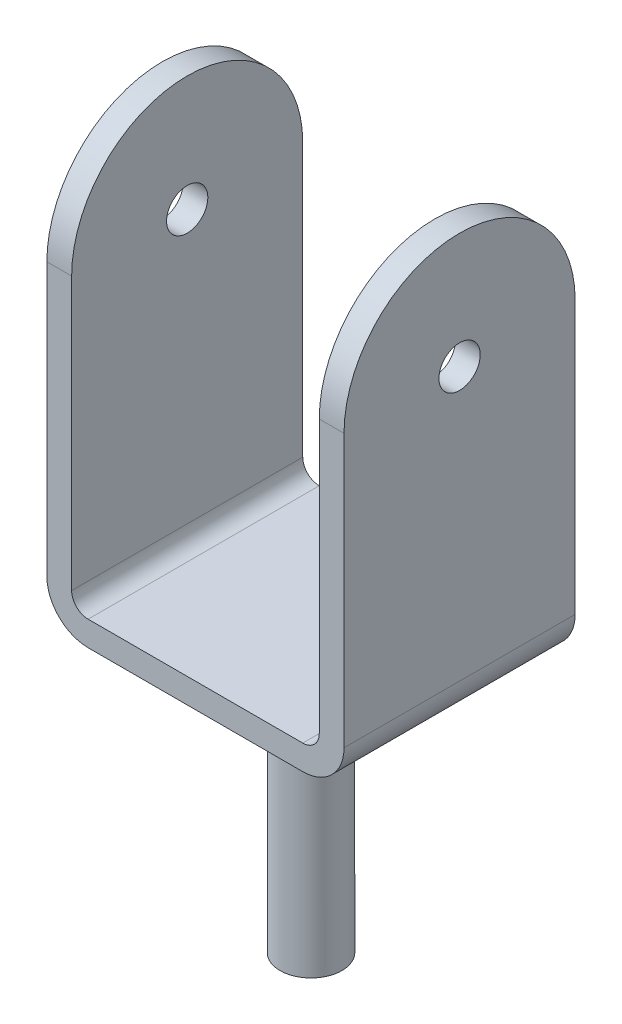
ISO-10303-21;
HEADER;
FILE_DESCRIPTION(('STEP AP214'),'2;1');
FILE_NAME('part.step','',(''),(''),'','','');
FILE_SCHEMA(('AUTOMOTIVE_DESIGN { 1 0 10303 214 1 1 1 1 }'));
ENDSEC;
DATA;
#1=APPLICATION_CONTEXT('core data for automotive mechanical design processes');
#2=APPLICATION_PROTOCOL_DEFINITION('international standard','automotive_design',2000,#1);
#3=PRODUCT_CONTEXT('',#1,'mechanical');
#4=PRODUCT('Part','Part','',(#3));
#5=PRODUCT_RELATED_PRODUCT_CATEGORY('part','',(#4));
#6=PRODUCT_DEFINITION_FORMATION('','',#4);
#7=PRODUCT_DEFINITION_CONTEXT('part definition',#1,'design');
#8=PRODUCT_DEFINITION('design','',#6,#7);
#9=PRODUCT_DEFINITION_SHAPE('','',#8);
#10=(LENGTH_UNIT() NAMED_UNIT(*) SI_UNIT(.MILLI.,.METRE.));
#11=(NAMED_UNIT(*) PLANE_ANGLE_UNIT() SI_UNIT($,.RADIAN.));
#12=(NAMED_UNIT(*) SI_UNIT($,.STERADIAN.) SOLID_ANGLE_UNIT());
#13=UNCERTAINTY_MEASURE_WITH_UNIT(LENGTH_MEASURE(1.E-05),#10,'distance_accuracy_value','');
#14=(GEOMETRIC_REPRESENTATION_CONTEXT(3) GLOBAL_UNCERTAINTY_ASSIGNED_CONTEXT((#13)) GLOBAL_UNIT_ASSIGNED_CONTEXT((#10,
#11,#12)) REPRESENTATION_CONTEXT('',''));
#15=CARTESIAN_POINT('',(0.,0.,0.));
#16=DIRECTION('',(0.,0.,1.));
#17=DIRECTION('',(1.,0.,0.));
#18=AXIS2_PLACEMENT_3D('',#15,#16,#17);
#19=CARTESIAN_POINT('',(130.,50.,-280.));
#20=DIRECTION('',(0.,0.,1.));
#21=DIRECTION('',(1.,0.,0.));
#22=AXIS2_PLACEMENT_3D('',#19,#20,#21);
#23=CYLINDRICAL_SURFACE('',#22,50.);
#24=CARTESIAN_POINT('',(130.,50.,0.));
#25=DIRECTION('',(0.,0.,1.));
#26=DIRECTION('',(1.,0.,0.));
#27=AXIS2_PLACEMENT_3D('',#24,#25,#26);
#28=CIRCLE('',#27,50.);
#29=CARTESIAN_POINT('',(130.,0.,0.));
#30=VERTEX_POINT('',#29);
#31=CARTESIAN_POINT('',(180.,50.0000000000004,0.));
#32=VERTEX_POINT('',#31);
#33=EDGE_CURVE('E147',#30,#32,#28,.T.);
#34=ORIENTED_EDGE('',*,*,#33,.F.);
#35=DIRECTION('',(0.,0.,1.));
#36=VECTOR('',#35,1.);
#37=CARTESIAN_POINT('',(130.,0.,-280.));
#38=LINE('',#37,#36);
#39=CARTESIAN_POINT('',(130.,0.,-280.));
#40=VERTEX_POINT('',#39);
#41=EDGE_CURVE('E45',#40,#30,#38,.T.);
#42=ORIENTED_EDGE('',*,*,#41,.F.);
#43=CARTESIAN_POINT('',(130.,50.,-280.));
#44=DIRECTION('',(0.,0.,1.));
#45=DIRECTION('',(1.,0.,0.));
#46=AXIS2_PLACEMENT_3D('',#43,#44,#45);
#47=CIRCLE('',#46,50.);
#48=CARTESIAN_POINT('',(180.,50.0000000000004,-280.));
#49=VERTEX_POINT('',#48);
#50=EDGE_CURVE('E181',#40,#49,#47,.T.);
#51=ORIENTED_EDGE('',*,*,#50,.T.);
#52=DIRECTION('',(0.,0.,1.));
#53=VECTOR('',#52,1.);
#54=CARTESIAN_POINT('',(180.,50.0000000000004,-280.));
#55=LINE('',#54,#53);
#56=EDGE_CURVE('E100',#49,#32,#55,.T.);
#57=ORIENTED_EDGE('',*,*,#56,.T.);
#58=EDGE_LOOP('',(#34,#42,#51,#57));
#59=FACE_BOUND('',#58,.T.);
#60=ADVANCED_FACE('F37',(#59),#23,.T.);
#61=CARTESIAN_POINT('',(-130.,0.,-280.));
#62=DIRECTION('',(0.,-1.,0.));
#63=DIRECTION('',(0.,0.,-1.));
#64=AXIS2_PLACEMENT_3D('',#61,#62,#63);
#65=PLANE('',#64);
#66=CARTESIAN_POINT('',(0.,0.,-140.));
#67=DIRECTION('',(0.,-1.,0.));
#68=DIRECTION('',(0.,0.,-1.));
#69=AXIS2_PLACEMENT_3D('',#66,#67,#68);
#70=CIRCLE('',#69,37.5);
#71=CARTESIAN_POINT('',(0.,0.,-177.5));
#72=VERTEX_POINT('',#71);
#73=EDGE_CURVE('E11',#72,#72,#70,.T.);
#74=ORIENTED_EDGE('',*,*,#73,.F.);
#75=EDGE_LOOP('',(#74));
#76=FACE_BOUND('',#75,.T.);
#77=DIRECTION('',(1.,0.,0.));
#78=VECTOR('',#77,1.);
#79=CARTESIAN_POINT('',(-130.,0.,0.));
#80=LINE('',#79,#78);
#81=CARTESIAN_POINT('',(-130.,0.,0.));
#82=VERTEX_POINT('',#81);
#83=EDGE_CURVE('E178',#82,#30,#80,.T.);
#84=ORIENTED_EDGE('',*,*,#83,.F.);
#85=DIRECTION('',(0.,0.,1.));
#86=VECTOR('',#85,1.);
#87=CARTESIAN_POINT('',(-130.,0.,-280.));
#88=LINE('',#87,#86);
#89=CARTESIAN_POINT('',(-130.,0.,-280.));
#90=VERTEX_POINT('',#89);
#91=EDGE_CURVE('E88',#90,#82,#88,.T.);
#92=ORIENTED_EDGE('',*,*,#91,.F.);
#93=DIRECTION('',(1.,0.,0.));
#94=VECTOR('',#93,1.);
#95=CARTESIAN_POINT('',(-130.,0.,-280.));
#96=LINE('',#95,#94);
#97=EDGE_CURVE('E134',#90,#40,#96,.T.);
#98=ORIENTED_EDGE('',*,*,#97,.T.);
#99=ORIENTED_EDGE('',*,*,#41,.T.);
#100=EDGE_LOOP('',(#84,#92,#98,#99));
#101=FACE_BOUND('',#100,.T.);
#102=ADVANCED_FACE('F196',(#76,#101),#65,.T.);
#103=CARTESIAN_POINT('',(-130.,50.,-280.));
#104=DIRECTION('',(0.,0.,1.));
#105=DIRECTION('',(1.,0.,0.));
#106=AXIS2_PLACEMENT_3D('',#103,#104,#105);
#107=CYLINDRICAL_SURFACE('',#106,50.);
#108=CARTESIAN_POINT('',(-130.,50.,0.));
#109=DIRECTION('',(0.,0.,1.));
#110=DIRECTION('',(-1.,0.,0.));
#111=AXIS2_PLACEMENT_3D('',#108,#109,#110);
#112=CIRCLE('',#111,50.);
#113=CARTESIAN_POINT('',(-180.,50.,0.));
#114=VERTEX_POINT('',#113);
#115=EDGE_CURVE('E121',#114,#82,#112,.T.);
#116=ORIENTED_EDGE('',*,*,#115,.F.);
#117=DIRECTION('',(0.,0.,1.));
#118=VECTOR('',#117,1.);
#119=CARTESIAN_POINT('',(-180.,50.,-280.));
#120=LINE('',#119,#118);
#121=CARTESIAN_POINT('',(-180.,50.,-280.));
#122=VERTEX_POINT('',#121);
#123=EDGE_CURVE('E116',#122,#114,#120,.T.);
#124=ORIENTED_EDGE('',*,*,#123,.F.);
#125=CARTESIAN_POINT('',(-130.,50.,-280.));
#126=DIRECTION('',(0.,0.,1.));
#127=DIRECTION('',(-1.,0.,0.));
#128=AXIS2_PLACEMENT_3D('',#125,#126,#127);
#129=CIRCLE('',#128,50.);
#130=EDGE_CURVE('E119',#122,#90,#129,.T.);
#131=ORIENTED_EDGE('',*,*,#130,.T.);
#132=ORIENTED_EDGE('',*,*,#91,.T.);
#133=EDGE_LOOP('',(#116,#124,#131,#132));
#134=FACE_BOUND('',#133,.T.);
#135=ADVANCED_FACE('F118',(#134),#107,.T.);
#136=CARTESIAN_POINT('',(-180.,50.0000000000004,-280.));
#137=DIRECTION('',(-1.,0.,0.));
#138=DIRECTION('',(0.,-1.,0.));
#139=AXIS2_PLACEMENT_3D('',#136,#137,#138);
#140=PLANE('',#139);
#141=CARTESIAN_POINT('',(-180.,380.,-140.));
#142=DIRECTION('',(1.,0.,0.));
#143=DIRECTION('',(0.,0.,-1.));
#144=AXIS2_PLACEMENT_3D('',#141,#142,#143);
#145=CIRCLE('',#144,25.);
#146=CARTESIAN_POINT('',(-180.,380.,-165.));
#147=VERTEX_POINT('',#146);
#148=EDGE_CURVE('E240',#147,#147,#145,.T.);
#149=ORIENTED_EDGE('',*,*,#148,.T.);
#150=EDGE_LOOP('',(#149));
#151=FACE_BOUND('',#150,.T.);
#152=DIRECTION('',(0.,-1.,0.));
#153=VECTOR('',#152,1.);
#154=CARTESIAN_POINT('',(-180.,50.0000000000004,0.));
#155=LINE('',#154,#153);
#156=CARTESIAN_POINT('',(-180.,380.,0.));
#157=VERTEX_POINT('',#156);
#158=EDGE_CURVE('E175',#157,#114,#155,.T.);
#159=ORIENTED_EDGE('',*,*,#158,.F.);
#160=CARTESIAN_POINT('',(-180.,380.,-140.));
#161=DIRECTION('',(1.,0.,0.));
#162=DIRECTION('',(0.,1.,0.));
#163=AXIS2_PLACEMENT_3D('',#160,#161,#162);
#164=CIRCLE('',#163,140.);
#165=CARTESIAN_POINT('',(-180.,380.,-280.));
#166=VERTEX_POINT('',#165);
#167=EDGE_CURVE('E138',#166,#157,#164,.T.);
#168=ORIENTED_EDGE('',*,*,#167,.F.);
#169=DIRECTION('',(0.,-1.,0.));
#170=VECTOR('',#169,1.);
#171=CARTESIAN_POINT('',(-180.,50.0000000000004,-280.));
#172=LINE('',#171,#170);
#173=EDGE_CURVE('E133',#166,#122,#172,.T.);
#174=ORIENTED_EDGE('',*,*,#173,.T.);
#175=ORIENTED_EDGE('',*,*,#123,.T.);
#176=EDGE_LOOP('',(#159,#168,#174,#175));
#177=FACE_BOUND('',#176,.T.);
#178=ADVANCED_FACE('F137',(#151,#177),#140,.T.);
#179=CARTESIAN_POINT('',(-150.,380.,-280.));
#180=DIRECTION('',(1.,0.,0.));
#181=DIRECTION('',(0.,1.,0.));
#182=AXIS2_PLACEMENT_3D('',#179,#180,#181);
#183=PLANE('',#182);
#184=CARTESIAN_POINT('',(-150.,380.,-140.));
#185=DIRECTION('',(1.,0.,0.));
#186=DIRECTION('',(0.,1.,0.));
#187=AXIS2_PLACEMENT_3D('',#184,#185,#186);
#188=CIRCLE('',#187,25.);
#189=CARTESIAN_POINT('',(-150.,405.,-140.));
#190=VERTEX_POINT('',#189);
#191=EDGE_CURVE('E251',#190,#190,#188,.T.);
#192=ORIENTED_EDGE('',*,*,#191,.F.);
#193=EDGE_LOOP('',(#192));
#194=FACE_BOUND('',#193,.T.);
#195=DIRECTION('',(0.,1.,0.));
#196=VECTOR('',#195,1.);
#197=CARTESIAN_POINT('',(-150.,380.,-280.));
#198=LINE('',#197,#196);
#199=CARTESIAN_POINT('',(-150.,50.0000000000001,-280.));
#200=VERTEX_POINT('',#199);
#201=CARTESIAN_POINT('',(-150.,380.,-280.));
#202=VERTEX_POINT('',#201);
#203=EDGE_CURVE('E142',#200,#202,#198,.T.);
#204=ORIENTED_EDGE('',*,*,#203,.T.);
#205=CARTESIAN_POINT('',(-150.,380.,-140.));
#206=DIRECTION('',(1.,0.,0.));
#207=DIRECTION('',(0.,1.,0.));
#208=AXIS2_PLACEMENT_3D('',#205,#206,#207);
#209=CIRCLE('',#208,140.);
#210=CARTESIAN_POINT('',(-150.,380.,0.));
#211=VERTEX_POINT('',#210);
#212=EDGE_CURVE('E254',#202,#211,#209,.T.);
#213=ORIENTED_EDGE('',*,*,#212,.T.);
#214=DIRECTION('',(0.,1.,0.));
#215=VECTOR('',#214,1.);
#216=CARTESIAN_POINT('',(-150.,380.,0.));
#217=LINE('',#216,#215);
#218=CARTESIAN_POINT('',(-150.,50.0000000000001,0.));
#219=VERTEX_POINT('',#218);
#220=EDGE_CURVE('E169',#219,#211,#217,.T.);
#221=ORIENTED_EDGE('',*,*,#220,.F.);
#222=DIRECTION('',(0.,0.,1.));
#223=VECTOR('',#222,1.);
#224=CARTESIAN_POINT('',(-150.,50.0000000000001,-280.));
#225=LINE('',#224,#223);
#226=EDGE_CURVE('E126',#200,#219,#225,.T.);
#227=ORIENTED_EDGE('',*,*,#226,.F.);
#228=EDGE_LOOP('',(#204,#213,#221,#227));
#229=FACE_BOUND('',#228,.T.);
#230=ADVANCED_FACE('F211',(#194,#229),#183,.T.);
#231=CARTESIAN_POINT('',(-130.,50.,-280.));
#232=DIRECTION('',(0.,0.,1.));
#233=DIRECTION('',(1.,0.,0.));
#234=AXIS2_PLACEMENT_3D('',#231,#232,#233);
#235=CYLINDRICAL_SURFACE('',#234,20.);
#236=CARTESIAN_POINT('',(-130.,50.,0.));
#237=DIRECTION('',(0.,0.,-1.));
#238=DIRECTION('',(1.,0.,0.));
#239=AXIS2_PLACEMENT_3D('',#236,#237,#238);
#240=CIRCLE('',#239,20.);
#241=CARTESIAN_POINT('',(-130.,30.,0.));
#242=VERTEX_POINT('',#241);
#243=EDGE_CURVE('E166',#242,#219,#240,.T.);
#244=ORIENTED_EDGE('',*,*,#243,.F.);
#245=DIRECTION('',(0.,0.,1.));
#246=VECTOR('',#245,1.);
#247=CARTESIAN_POINT('',(-130.,30.,-280.));
#248=LINE('',#247,#246);
#249=CARTESIAN_POINT('',(-130.,30.,-280.));
#250=VERTEX_POINT('',#249);
#251=EDGE_CURVE('E185',#250,#242,#248,.T.);
#252=ORIENTED_EDGE('',*,*,#251,.F.);
#253=CARTESIAN_POINT('',(-130.,50.,-280.));
#254=DIRECTION('',(0.,0.,-1.));
#255=DIRECTION('',(1.,0.,0.));
#256=AXIS2_PLACEMENT_3D('',#253,#254,#255);
#257=CIRCLE('',#256,20.);
#258=EDGE_CURVE('E277',#250,#200,#257,.T.);
#259=ORIENTED_EDGE('',*,*,#258,.T.);
#260=ORIENTED_EDGE('',*,*,#226,.T.);
#261=EDGE_LOOP('',(#244,#252,#259,#260));
#262=FACE_BOUND('',#261,.T.);
#263=ADVANCED_FACE('F215',(#262),#235,.F.);
#264=CARTESIAN_POINT('',(-130.,30.,-280.));
#265=DIRECTION('',(0.,1.,0.));
#266=DIRECTION('',(0.,0.,1.));
#267=AXIS2_PLACEMENT_3D('',#264,#265,#266);
#268=PLANE('',#267);
#269=DIRECTION('',(-1.,0.,0.));
#270=VECTOR('',#269,1.);
#271=CARTESIAN_POINT('',(-130.,30.,0.));
#272=LINE('',#271,#270);
#273=CARTESIAN_POINT('',(130.,30.,0.));
#274=VERTEX_POINT('',#273);
#275=EDGE_CURVE('E163',#274,#242,#272,.T.);
#276=ORIENTED_EDGE('',*,*,#275,.F.);
#277=DIRECTION('',(0.,0.,1.));
#278=VECTOR('',#277,1.);
#279=CARTESIAN_POINT('',(130.,30.,-280.));
#280=LINE('',#279,#278);
#281=CARTESIAN_POINT('',(130.,30.,-280.));
#282=VERTEX_POINT('',#281);
#283=EDGE_CURVE('E187',#282,#274,#280,.T.);
#284=ORIENTED_EDGE('',*,*,#283,.F.);
#285=DIRECTION('',(-1.,0.,0.));
#286=VECTOR('',#285,1.);
#287=CARTESIAN_POINT('',(-130.,30.,-280.));
#288=LINE('',#287,#286);
#289=EDGE_CURVE('E274',#282,#250,#288,.T.);
#290=ORIENTED_EDGE('',*,*,#289,.T.);
#291=ORIENTED_EDGE('',*,*,#251,.T.);
#292=EDGE_LOOP('',(#276,#284,#290,#291));
#293=FACE_BOUND('',#292,.T.);
#294=ADVANCED_FACE('F219',(#293),#268,.T.);
#295=CARTESIAN_POINT('',(130.,50.,-280.));
#296=DIRECTION('',(0.,0.,1.));
#297=DIRECTION('',(1.,0.,0.));
#298=AXIS2_PLACEMENT_3D('',#295,#296,#297);
#299=CYLINDRICAL_SURFACE('',#298,20.);
#300=CARTESIAN_POINT('',(130.,50.,0.));
#301=DIRECTION('',(0.,0.,-1.));
#302=DIRECTION('',(1.,0.,0.));
#303=AXIS2_PLACEMENT_3D('',#300,#301,#302);
#304=CIRCLE('',#303,20.);
#305=CARTESIAN_POINT('',(150.,50.,0.));
#306=VERTEX_POINT('',#305);
#307=EDGE_CURVE('E160',#306,#274,#304,.T.);
#308=ORIENTED_EDGE('',*,*,#307,.F.);
#309=DIRECTION('',(0.,0.,1.));
#310=VECTOR('',#309,1.);
#311=CARTESIAN_POINT('',(150.,50.,-280.));
#312=LINE('',#311,#310);
#313=CARTESIAN_POINT('',(150.,50.,-280.));
#314=VERTEX_POINT('',#313);
#315=EDGE_CURVE('E189',#314,#306,#312,.T.);
#316=ORIENTED_EDGE('',*,*,#315,.F.);
#317=CARTESIAN_POINT('',(130.,50.,-280.));
#318=DIRECTION('',(0.,0.,-1.));
#319=DIRECTION('',(1.,0.,0.));
#320=AXIS2_PLACEMENT_3D('',#317,#318,#319);
#321=CIRCLE('',#320,20.);
#322=EDGE_CURVE('E271',#314,#282,#321,.T.);
#323=ORIENTED_EDGE('',*,*,#322,.T.);
#324=ORIENTED_EDGE('',*,*,#283,.T.);
#325=EDGE_LOOP('',(#308,#316,#323,#324));
#326=FACE_BOUND('',#325,.T.);
#327=ADVANCED_FACE('F223',(#326),#299,.F.);
#328=CARTESIAN_POINT('',(150.,50.0000000000001,-280.));
#329=DIRECTION('',(-1.,0.,0.));
#330=DIRECTION('',(0.,-1.,0.));
#331=AXIS2_PLACEMENT_3D('',#328,#329,#330);
#332=PLANE('',#331);
#333=CARTESIAN_POINT('',(150.,380.,-140.));
#334=DIRECTION('',(-1.,0.,0.));
#335=DIRECTION('',(0.,-1.,0.));
#336=AXIS2_PLACEMENT_3D('',#333,#334,#335);
#337=CIRCLE('',#336,25.);
#338=CARTESIAN_POINT('',(150.,355.,-140.));
#339=VERTEX_POINT('',#338);
#340=EDGE_CURVE('E244',#339,#339,#337,.T.);
#341=ORIENTED_EDGE('',*,*,#340,.F.);
#342=EDGE_LOOP('',(#341));
#343=FACE_BOUND('',#342,.T.);
#344=DIRECTION('',(0.,-1.,0.));
#345=VECTOR('',#344,1.);
#346=CARTESIAN_POINT('',(150.,50.0000000000001,0.));
#347=LINE('',#346,#345);
#348=CARTESIAN_POINT('',(150.,380.,0.));
#349=VERTEX_POINT('',#348);
#350=EDGE_CURVE('E157',#349,#306,#347,.T.);
#351=ORIENTED_EDGE('',*,*,#350,.F.);
#352=CARTESIAN_POINT('',(150.,380.,-140.));
#353=DIRECTION('',(-1.,0.,0.));
#354=DIRECTION('',(0.,-1.,0.));
#355=AXIS2_PLACEMENT_3D('',#352,#353,#354);
#356=CIRCLE('',#355,140.);
#357=CARTESIAN_POINT('',(150.,380.,-280.));
#358=VERTEX_POINT('',#357);
#359=EDGE_CURVE('E256',#349,#358,#356,.T.);
#360=ORIENTED_EDGE('',*,*,#359,.T.);
#361=DIRECTION('',(0.,-1.,0.));
#362=VECTOR('',#361,1.);
#363=CARTESIAN_POINT('',(150.,50.0000000000001,-280.));
#364=LINE('',#363,#362);
#365=EDGE_CURVE('E268',#358,#314,#364,.T.);
#366=ORIENTED_EDGE('',*,*,#365,.T.);
#367=ORIENTED_EDGE('',*,*,#315,.T.);
#368=EDGE_LOOP('',(#351,#360,#366,#367));
#369=FACE_BOUND('',#368,.T.);
#370=ADVANCED_FACE('F227',(#343,#369),#332,.T.);
#371=CARTESIAN_POINT('',(180.,380.,-280.));
#372=DIRECTION('',(1.,0.,0.));
#373=DIRECTION('',(0.,1.,0.));
#374=AXIS2_PLACEMENT_3D('',#371,#372,#373);
#375=PLANE('',#374);
#376=CARTESIAN_POINT('',(180.,380.,-140.));
#377=DIRECTION('',(1.,0.,0.));
#378=DIRECTION('',(0.,0.,-1.));
#379=AXIS2_PLACEMENT_3D('',#376,#377,#378);
#380=CIRCLE('',#379,25.);
#381=CARTESIAN_POINT('',(180.,380.,-165.));
#382=VERTEX_POINT('',#381);
#383=EDGE_CURVE('E238',#382,#382,#380,.T.);
#384=ORIENTED_EDGE('',*,*,#383,.F.);
#385=EDGE_LOOP('',(#384));
#386=FACE_BOUND('',#385,.T.);
#387=DIRECTION('',(0.,1.,0.));
#388=VECTOR('',#387,1.);
#389=CARTESIAN_POINT('',(180.,380.,-280.));
#390=LINE('',#389,#388);
#391=CARTESIAN_POINT('',(180.,380.,-280.));
#392=VERTEX_POINT('',#391);
#393=EDGE_CURVE('E263',#49,#392,#390,.T.);
#394=ORIENTED_EDGE('',*,*,#393,.T.);
#395=CARTESIAN_POINT('',(180.,380.,-140.));
#396=DIRECTION('',(-1.,0.,0.));
#397=DIRECTION('',(0.,-1.,0.));
#398=AXIS2_PLACEMENT_3D('',#395,#396,#397);
#399=CIRCLE('',#398,140.);
#400=CARTESIAN_POINT('',(180.,380.,0.));
#401=VERTEX_POINT('',#400);
#402=EDGE_CURVE('E151',#401,#392,#399,.T.);
#403=ORIENTED_EDGE('',*,*,#402,.F.);
#404=DIRECTION('',(0.,1.,0.));
#405=VECTOR('',#404,1.);
#406=CARTESIAN_POINT('',(180.,380.,0.));
#407=LINE('',#406,#405);
#408=EDGE_CURVE('E150',#32,#401,#407,.T.);
#409=ORIENTED_EDGE('',*,*,#408,.F.);
#410=ORIENTED_EDGE('',*,*,#56,.F.);
#411=EDGE_LOOP('',(#394,#403,#409,#410));
#412=FACE_BOUND('',#411,.T.);
#413=ADVANCED_FACE('F191',(#386,#412),#375,.T.);
#414=CARTESIAN_POINT('',(130.,50.,-280.));
#415=DIRECTION('',(0.,0.,1.));
#416=DIRECTION('',(1.,0.,0.));
#417=AXIS2_PLACEMENT_3D('',#414,#415,#416);
#418=PLANE('',#417);
#419=ORIENTED_EDGE('',*,*,#50,.F.);
#420=ORIENTED_EDGE('',*,*,#97,.F.);
#421=ORIENTED_EDGE('',*,*,#130,.F.);
#422=ORIENTED_EDGE('',*,*,#173,.F.);
#423=DIRECTION('',(-1.,0.,0.));
#424=VECTOR('',#423,1.);
#425=CARTESIAN_POINT('',(-180.,380.,-280.));
#426=LINE('',#425,#424);
#427=EDGE_CURVE('E139',#202,#166,#426,.T.);
#428=ORIENTED_EDGE('',*,*,#427,.F.);
#429=ORIENTED_EDGE('',*,*,#203,.F.);
#430=ORIENTED_EDGE('',*,*,#258,.F.);
#431=ORIENTED_EDGE('',*,*,#289,.F.);
#432=ORIENTED_EDGE('',*,*,#322,.F.);
#433=ORIENTED_EDGE('',*,*,#365,.F.);
#434=DIRECTION('',(-1.,0.,0.));
#435=VECTOR('',#434,1.);
#436=CARTESIAN_POINT('',(150.,380.,-280.));
#437=LINE('',#436,#435);
#438=EDGE_CURVE('E265',#392,#358,#437,.T.);
#439=ORIENTED_EDGE('',*,*,#438,.F.);
#440=ORIENTED_EDGE('',*,*,#393,.F.);
#441=EDGE_LOOP('',(#419,#420,#421,#422,#428,#429,#430,#431,#432,#433,#439,#440));
#442=FACE_BOUND('',#441,.T.);
#443=ADVANCED_FACE('F130',(#442),#418,.F.);
#444=CARTESIAN_POINT('',(130.,50.,0.));
#445=DIRECTION('',(0.,0.,1.));
#446=DIRECTION('',(1.,0.,0.));
#447=AXIS2_PLACEMENT_3D('',#444,#445,#446);
#448=PLANE('',#447);
#449=ORIENTED_EDGE('',*,*,#33,.T.);
#450=ORIENTED_EDGE('',*,*,#408,.T.);
#451=DIRECTION('',(-1.,0.,0.));
#452=VECTOR('',#451,1.);
#453=CARTESIAN_POINT('',(150.,380.,0.));
#454=LINE('',#453,#452);
#455=EDGE_CURVE('E154',#401,#349,#454,.T.);
#456=ORIENTED_EDGE('',*,*,#455,.T.);
#457=ORIENTED_EDGE('',*,*,#350,.T.);
#458=ORIENTED_EDGE('',*,*,#307,.T.);
#459=ORIENTED_EDGE('',*,*,#275,.T.);
#460=ORIENTED_EDGE('',*,*,#243,.T.);
#461=ORIENTED_EDGE('',*,*,#220,.T.);
#462=DIRECTION('',(-1.,0.,0.));
#463=VECTOR('',#462,1.);
#464=CARTESIAN_POINT('',(-180.,380.,0.));
#465=LINE('',#464,#463);
#466=EDGE_CURVE('E172',#211,#157,#465,.T.);
#467=ORIENTED_EDGE('',*,*,#466,.T.);
#468=ORIENTED_EDGE('',*,*,#158,.T.);
#469=ORIENTED_EDGE('',*,*,#115,.T.);
#470=ORIENTED_EDGE('',*,*,#83,.T.);
#471=EDGE_LOOP('',(#449,#450,#456,#457,#458,#459,#460,#461,#467,#468,#469,#470));
#472=FACE_BOUND('',#471,.T.);
#473=ADVANCED_FACE('F195',(#472),#448,.T.);
#474=CARTESIAN_POINT('',(180.,380.,-140.));
#475=DIRECTION('',(-1.,0.,0.));
#476=DIRECTION('',(0.,0.,1.));
#477=AXIS2_PLACEMENT_3D('',#474,#475,#476);
#478=CYLINDRICAL_SURFACE('',#477,140.);
#479=ORIENTED_EDGE('',*,*,#402,.T.);
#480=ORIENTED_EDGE('',*,*,#438,.T.);
#481=ORIENTED_EDGE('',*,*,#359,.F.);
#482=ORIENTED_EDGE('',*,*,#455,.F.);
#483=EDGE_LOOP('',(#479,#480,#481,#482));
#484=FACE_BOUND('',#483,.T.);
#485=ADVANCED_FACE('F306',(#484),#478,.T.);
#486=CARTESIAN_POINT('',(-180.,380.,-140.));
#487=DIRECTION('',(1.,0.,0.));
#488=DIRECTION('',(0.,0.,-1.));
#489=AXIS2_PLACEMENT_3D('',#486,#487,#488);
#490=CYLINDRICAL_SURFACE('',#489,140.);
#491=ORIENTED_EDGE('',*,*,#427,.T.);
#492=ORIENTED_EDGE('',*,*,#167,.T.);
#493=ORIENTED_EDGE('',*,*,#466,.F.);
#494=ORIENTED_EDGE('',*,*,#212,.F.);
#495=EDGE_LOOP('',(#491,#492,#493,#494));
#496=FACE_BOUND('',#495,.T.);
#497=ADVANCED_FACE('F305',(#496),#490,.T.);
#498=CARTESIAN_POINT('',(-180.,380.,-140.));
#499=DIRECTION('',(1.,0.,0.));
#500=DIRECTION('',(0.,0.,-1.));
#501=AXIS2_PLACEMENT_3D('',#498,#499,#500);
#502=CYLINDRICAL_SURFACE('',#501,25.);
#503=ORIENTED_EDGE('',*,*,#340,.T.);
#504=EDGE_LOOP('',(#503));
#505=FACE_BOUND('',#504,.T.);
#506=ORIENTED_EDGE('',*,*,#383,.T.);
#507=EDGE_LOOP('',(#506));
#508=FACE_BOUND('',#507,.T.);
#509=ADVANCED_FACE('F313',(#505,#508),#502,.F.);
#510=ORIENTED_EDGE('',*,*,#191,.T.);
#511=EDGE_LOOP('',(#510));
#512=FACE_BOUND('',#511,.T.);
#513=ORIENTED_EDGE('',*,*,#148,.F.);
#514=EDGE_LOOP('',(#513));
#515=FACE_BOUND('',#514,.T.);
#516=ADVANCED_FACE('F318',(#512,#515),#502,.F.);
#517=CARTESIAN_POINT('',(0.,-325.,-140.));
#518=DIRECTION('',(0.,1.,0.));
#519=DIRECTION('',(0.,0.,1.));
#520=AXIS2_PLACEMENT_3D('',#517,#518,#519);
#521=CYLINDRICAL_SURFACE('',#520,37.5);
#522=CARTESIAN_POINT('',(0.,-325.,-140.));
#523=DIRECTION('',(0.,1.,0.));
#524=DIRECTION('',(0.,0.,1.));
#525=AXIS2_PLACEMENT_3D('',#522,#523,#524);
#526=CIRCLE('',#525,37.5);
#527=CARTESIAN_POINT('',(0.,-325.,-102.5));
#528=VERTEX_POINT('',#527);
#529=EDGE_CURVE('E241',#528,#528,#526,.T.);
#530=ORIENTED_EDGE('',*,*,#529,.T.);
#531=EDGE_LOOP('',(#530));
#532=FACE_BOUND('',#531,.T.);
#533=ORIENTED_EDGE('',*,*,#73,.T.);
#534=EDGE_LOOP('',(#533));
#535=FACE_BOUND('',#534,.T.);
#536=ADVANCED_FACE('F320',(#532,#535),#521,.T.);
#537=CARTESIAN_POINT('',(0.,-325.,-140.));
#538=DIRECTION('',(0.,1.,0.));
#539=DIRECTION('',(0.,0.,1.));
#540=AXIS2_PLACEMENT_3D('',#537,#538,#539);
#541=PLANE('',#540);
#542=ORIENTED_EDGE('',*,*,#529,.F.);
#543=EDGE_LOOP('',(#542));
#544=FACE_BOUND('',#543,.T.);
#545=ADVANCED_FACE('F323',(#544),#541,.F.);
#546=CLOSED_SHELL('',(#60,#102,#135,#178,#230,#263,#294,#327,#370,#413,#443,#473,#485,#497,#509,
#516,#536,#545));
#547=MANIFOLD_SOLID_BREP('B2',#546);
#548=ADVANCED_BREP_SHAPE_REPRESENTATION('',(#18,#547),#14);
#549=SHAPE_DEFINITION_REPRESENTATION(#9,#548);
ENDSEC;
END-ISO-10303-21;
